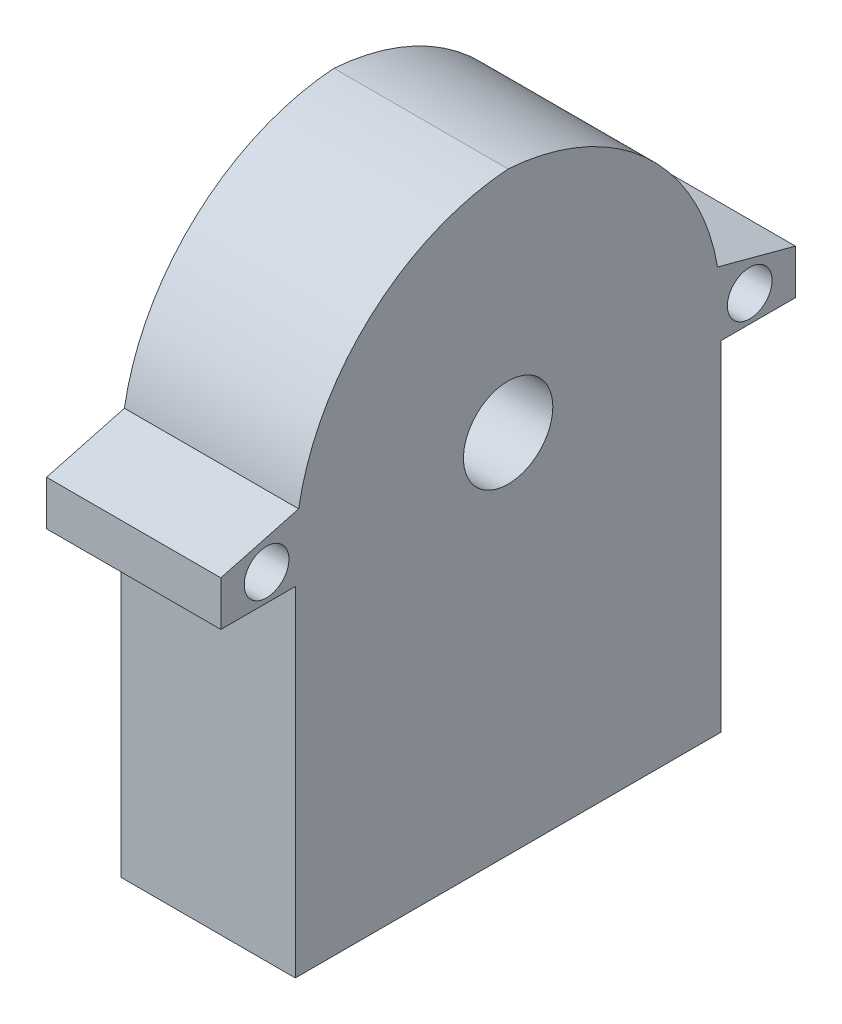
ISO-10303-21;
HEADER;
FILE_DESCRIPTION(('STEP AP214'),'2;1');
FILE_NAME('part.step','',(''),(''),'','','');
FILE_SCHEMA(('AUTOMOTIVE_DESIGN { 1 0 10303 214 1 1 1 1 }'));
ENDSEC;
DATA;
#1=APPLICATION_CONTEXT('core data for automotive mechanical design processes');
#2=APPLICATION_PROTOCOL_DEFINITION('international standard','automotive_design',2000,#1);
#3=PRODUCT_CONTEXT('',#1,'mechanical');
#4=PRODUCT('Part','Part','',(#3));
#5=PRODUCT_RELATED_PRODUCT_CATEGORY('part','',(#4));
#6=PRODUCT_DEFINITION_FORMATION('','',#4);
#7=PRODUCT_DEFINITION_CONTEXT('part definition',#1,'design');
#8=PRODUCT_DEFINITION('design','',#6,#7);
#9=PRODUCT_DEFINITION_SHAPE('','',#8);
#10=(LENGTH_UNIT() NAMED_UNIT(*) SI_UNIT(.MILLI.,.METRE.));
#11=(NAMED_UNIT(*) PLANE_ANGLE_UNIT() SI_UNIT($,.RADIAN.));
#12=(NAMED_UNIT(*) SI_UNIT($,.STERADIAN.) SOLID_ANGLE_UNIT());
#13=UNCERTAINTY_MEASURE_WITH_UNIT(LENGTH_MEASURE(1.E-05),#10,'distance_accuracy_value','');
#14=(GEOMETRIC_REPRESENTATION_CONTEXT(3) GLOBAL_UNCERTAINTY_ASSIGNED_CONTEXT((#13)) GLOBAL_UNIT_ASSIGNED_CONTEXT((#10,
#11,#12)) REPRESENTATION_CONTEXT('',''));
#15=CARTESIAN_POINT('',(0.,0.,0.));
#16=DIRECTION('',(0.,0.,1.));
#17=DIRECTION('',(1.,0.,0.));
#18=AXIS2_PLACEMENT_3D('',#15,#16,#17);
#19=CARTESIAN_POINT('',(11.7,20.896432160804,42.3673366834171));
#20=DIRECTION('',(0.,0.,-1.));
#21=DIRECTION('',(0.,1.,0.));
#22=AXIS2_PLACEMENT_3D('',#19,#20,#21);
#23=PLANE('',#22);
#24=DIRECTION('',(0.,-1.,0.));
#25=VECTOR('',#24,1.);
#26=CARTESIAN_POINT('',(11.7,20.896432160804,42.3673366834171));
#27=LINE('',#26,#25);
#28=CARTESIAN_POINT('',(11.7,3.72344059561265,42.3673366834171));
#29=VERTEX_POINT('',#28);
#30=CARTESIAN_POINT('',(11.7,-19.043567839196,42.3673366834171));
#31=VERTEX_POINT('',#30);
#32=EDGE_CURVE('E200',#29,#31,#27,.T.);
#33=ORIENTED_EDGE('',*,*,#32,.F.);
#34=DIRECTION('',(1.,0.,0.));
#35=VECTOR('',#34,1.);
#36=CARTESIAN_POINT('',(0.,3.72344059561265,42.3673366834171));
#37=LINE('',#36,#35);
#38=CARTESIAN_POINT('',(0.,3.72344059561265,42.3673366834171));
#39=VERTEX_POINT('',#38);
#40=EDGE_CURVE('E163',#39,#29,#37,.T.);
#41=ORIENTED_EDGE('',*,*,#40,.F.);
#42=DIRECTION('',(0.,-1.,0.));
#43=VECTOR('',#42,1.);
#44=CARTESIAN_POINT('',(0.,20.896432160804,42.3673366834171));
#45=LINE('',#44,#43);
#46=CARTESIAN_POINT('',(0.,-19.043567839196,42.3673366834171));
#47=VERTEX_POINT('',#46);
#48=EDGE_CURVE('E162',#39,#47,#45,.T.);
#49=ORIENTED_EDGE('',*,*,#48,.T.);
#50=DIRECTION('',(-1.,0.,0.));
#51=VECTOR('',#50,1.);
#52=CARTESIAN_POINT('',(11.7,-19.043567839196,42.3673366834171));
#53=LINE('',#52,#51);
#54=EDGE_CURVE('E148',#31,#47,#53,.T.);
#55=ORIENTED_EDGE('',*,*,#54,.F.);
#56=EDGE_LOOP('',(#33,#41,#49,#55));
#57=FACE_BOUND('',#56,.T.);
#58=ADVANCED_FACE('F39',(#57),#23,.F.);
#59=CARTESIAN_POINT('',(11.7,-19.043567839196,42.3673366834171));
#60=DIRECTION('',(0.,1.,0.));
#61=DIRECTION('',(0.,0.,1.));
#62=AXIS2_PLACEMENT_3D('',#59,#60,#61);
#63=PLANE('',#62);
#64=DIRECTION('',(0.,0.,-1.));
#65=VECTOR('',#64,1.);
#66=CARTESIAN_POINT('',(0.,-19.043567839196,42.3673366834171));
#67=LINE('',#66,#65);
#68=CARTESIAN_POINT('',(0.,-19.043567839196,13.7873366834171));
#69=VERTEX_POINT('',#68);
#70=EDGE_CURVE('E164',#47,#69,#67,.T.);
#71=ORIENTED_EDGE('',*,*,#70,.T.);
#72=DIRECTION('',(-1.,0.,0.));
#73=VECTOR('',#72,1.);
#74=CARTESIAN_POINT('',(11.7,-19.043567839196,13.7873366834171));
#75=LINE('',#74,#73);
#76=CARTESIAN_POINT('',(11.7,-19.043567839196,13.7873366834171));
#77=VERTEX_POINT('',#76);
#78=EDGE_CURVE('E152',#77,#69,#75,.T.);
#79=ORIENTED_EDGE('',*,*,#78,.F.);
#80=DIRECTION('',(0.,0.,-1.));
#81=VECTOR('',#80,1.);
#82=CARTESIAN_POINT('',(11.7,-19.043567839196,42.3673366834171));
#83=LINE('',#82,#81);
#84=EDGE_CURVE('E202',#31,#77,#83,.T.);
#85=ORIENTED_EDGE('',*,*,#84,.F.);
#86=ORIENTED_EDGE('',*,*,#54,.T.);
#87=EDGE_LOOP('',(#71,#79,#85,#86));
#88=FACE_BOUND('',#87,.T.);
#89=ADVANCED_FACE('F227',(#88),#63,.F.);
#90=CARTESIAN_POINT('',(11.7,-19.043567839196,13.7873366834171));
#91=DIRECTION('',(0.,0.,1.));
#92=DIRECTION('',(1.,0.,0.));
#93=AXIS2_PLACEMENT_3D('',#90,#91,#92);
#94=PLANE('',#93);
#95=DIRECTION('',(0.,1.,0.));
#96=VECTOR('',#95,1.);
#97=CARTESIAN_POINT('',(0.,-19.043567839196,13.7873366834171));
#98=LINE('',#97,#96);
#99=CARTESIAN_POINT('',(0.,3.72344059561265,13.7873366834171));
#100=VERTEX_POINT('',#99);
#101=EDGE_CURVE('E203',#69,#100,#98,.T.);
#102=ORIENTED_EDGE('',*,*,#101,.T.);
#103=DIRECTION('',(1.,0.,0.));
#104=VECTOR('',#103,1.);
#105=CARTESIAN_POINT('',(0.,3.72344059561265,13.7873366834171));
#106=LINE('',#105,#104);
#107=CARTESIAN_POINT('',(11.7,3.72344059561265,13.7873366834171));
#108=VERTEX_POINT('',#107);
#109=EDGE_CURVE('E176',#100,#108,#106,.T.);
#110=ORIENTED_EDGE('',*,*,#109,.T.);
#111=DIRECTION('',(0.,1.,0.));
#112=VECTOR('',#111,1.);
#113=CARTESIAN_POINT('',(11.7,-19.043567839196,13.7873366834171));
#114=LINE('',#113,#112);
#115=EDGE_CURVE('E205',#77,#108,#114,.T.);
#116=ORIENTED_EDGE('',*,*,#115,.F.);
#117=ORIENTED_EDGE('',*,*,#78,.T.);
#118=EDGE_LOOP('',(#102,#110,#116,#117));
#119=FACE_BOUND('',#118,.T.);
#120=ADVANCED_FACE('F215',(#119),#94,.F.);
#121=CARTESIAN_POINT('',(11.7,0.,0.));
#122=DIRECTION('',(1.,0.,0.));
#123=DIRECTION('',(0.,0.,-1.));
#124=AXIS2_PLACEMENT_3D('',#121,#122,#123);
#125=PLANE('',#124);
#126=CARTESIAN_POINT('',(11.7,5.52637682216266,28.0773366834171));
#127=DIRECTION('',(1.,0.,0.));
#128=DIRECTION('',(0.,0.,-1.));
#129=AXIS2_PLACEMENT_3D('',#126,#127,#128);
#130=CIRCLE('',#129,3.);
#131=CARTESIAN_POINT('',(11.7,5.52637682216266,25.0773366834171));
#132=VERTEX_POINT('',#131);
#133=EDGE_CURVE('E376',#132,#132,#130,.T.);
#134=ORIENTED_EDGE('',*,*,#133,.F.);
#135=EDGE_LOOP('',(#134));
#136=FACE_BOUND('',#135,.T.);
#137=CARTESIAN_POINT('',(11.7,5.52637682216266,44.2973366834171));
#138=DIRECTION('',(1.,0.,0.));
#139=DIRECTION('',(0.,0.,-1.));
#140=AXIS2_PLACEMENT_3D('',#137,#138,#139);
#141=CIRCLE('',#140,1.5);
#142=CARTESIAN_POINT('',(11.7,5.52637682216266,42.7973366834171));
#143=VERTEX_POINT('',#142);
#144=EDGE_CURVE('E383',#143,#143,#141,.T.);
#145=ORIENTED_EDGE('',*,*,#144,.F.);
#146=EDGE_LOOP('',(#145));
#147=FACE_BOUND('',#146,.T.);
#148=CARTESIAN_POINT('',(11.7,5.52637682216266,11.8573366834171));
#149=DIRECTION('',(1.,0.,0.));
#150=DIRECTION('',(0.,0.,-1.));
#151=AXIS2_PLACEMENT_3D('',#148,#149,#150);
#152=CIRCLE('',#151,1.5);
#153=CARTESIAN_POINT('',(11.7,5.52637682216266,10.3573366834171));
#154=VERTEX_POINT('',#153);
#155=EDGE_CURVE('E386',#154,#154,#152,.T.);
#156=ORIENTED_EDGE('',*,*,#155,.F.);
#157=EDGE_LOOP('',(#156));
#158=FACE_BOUND('',#157,.T.);
#159=DIRECTION('',(0.,0.,-1.));
#160=VECTOR('',#159,1.);
#161=CARTESIAN_POINT('',(11.7,3.72344059561265,47.3673366834171));
#162=LINE('',#161,#160);
#163=CARTESIAN_POINT('',(11.7,3.72344059561265,47.3673366834171));
#164=VERTEX_POINT('',#163);
#165=EDGE_CURVE('E143',#164,#29,#162,.T.);
#166=ORIENTED_EDGE('',*,*,#165,.T.);
#167=ORIENTED_EDGE('',*,*,#32,.T.);
#168=ORIENTED_EDGE('',*,*,#84,.T.);
#169=ORIENTED_EDGE('',*,*,#115,.T.);
#170=DIRECTION('',(0.,0.,-1.));
#171=VECTOR('',#170,1.);
#172=CARTESIAN_POINT('',(11.7,3.72344059561265,13.7873366834171));
#173=LINE('',#172,#171);
#174=CARTESIAN_POINT('',(11.7,3.72344059561265,8.78733668341708));
#175=VERTEX_POINT('',#174);
#176=EDGE_CURVE('E191',#108,#175,#173,.T.);
#177=ORIENTED_EDGE('',*,*,#176,.T.);
#178=DIRECTION('',(0.,1.,0.));
#179=VECTOR('',#178,1.);
#180=CARTESIAN_POINT('',(11.7,3.72344059561265,8.78733668341708));
#181=LINE('',#180,#179);
#182=CARTESIAN_POINT('',(11.7,6.72344059561265,8.78733668341708));
#183=VERTEX_POINT('',#182);
#184=EDGE_CURVE('E188',#175,#183,#181,.T.);
#185=ORIENTED_EDGE('',*,*,#184,.T.);
#186=DIRECTION('',(0.,0.258819045102518,0.965925826289069));
#187=VECTOR('',#186,1.);
#188=CARTESIAN_POINT('',(11.7,6.72344059561265,8.78733668341708));
#189=LINE('',#188,#187);
#190=CARTESIAN_POINT('',(11.7,8.12367862218153,14.0130961412621));
#191=VERTEX_POINT('',#190);
#192=EDGE_CURVE('E54',#183,#191,#189,.T.);
#193=ORIENTED_EDGE('',*,*,#192,.T.);
#194=CARTESIAN_POINT('',(11.7,5.49643216080401,29.1873366834171));
#195=DIRECTION('',(1.,0.,0.));
#196=DIRECTION('',(0.,0.,-1.));
#197=AXIS2_PLACEMENT_3D('',#194,#195,#196);
#198=CIRCLE('',#197,15.4);
#199=CARTESIAN_POINT('',(11.7,20.8563768221627,28.0773366834171));
#200=VERTEX_POINT('',#199);
#201=EDGE_CURVE('E11',#191,#200,#198,.T.);
#202=ORIENTED_EDGE('',*,*,#201,.T.);
#203=CARTESIAN_POINT('',(11.7,5.49643216080401,26.9673366834171));
#204=DIRECTION('',(1.,0.,0.));
#205=DIRECTION('',(0.,0.,-1.));
#206=AXIS2_PLACEMENT_3D('',#203,#204,#205);
#207=CIRCLE('',#206,15.4);
#208=CARTESIAN_POINT('',(11.7,8.12367862218152,42.141577225572));
#209=VERTEX_POINT('',#208);
#210=EDGE_CURVE('E48',#200,#209,#207,.T.);
#211=ORIENTED_EDGE('',*,*,#210,.T.);
#212=DIRECTION('',(0.,-0.258819045102519,0.965925826289069));
#213=VECTOR('',#212,1.);
#214=CARTESIAN_POINT('',(11.7,8.12367862218152,42.141577225572));
#215=LINE('',#214,#213);
#216=CARTESIAN_POINT('',(11.7,6.72344059561265,47.3673366834171));
#217=VERTEX_POINT('',#216);
#218=EDGE_CURVE('E127',#209,#217,#215,.T.);
#219=ORIENTED_EDGE('',*,*,#218,.T.);
#220=DIRECTION('',(0.,-1.,0.));
#221=VECTOR('',#220,1.);
#222=CARTESIAN_POINT('',(11.7,6.72344059561265,47.3673366834171));
#223=LINE('',#222,#221);
#224=EDGE_CURVE('E232',#217,#164,#223,.T.);
#225=ORIENTED_EDGE('',*,*,#224,.T.);
#226=EDGE_LOOP('',(#166,#167,#168,#169,#177,#185,#193,#202,#211,#219,#225));
#227=FACE_BOUND('',#226,.T.);
#228=ADVANCED_FACE('F157',(#136,#147,#158,#227),#125,.T.);
#229=CARTESIAN_POINT('',(0.,0.,0.));
#230=DIRECTION('',(1.,0.,0.));
#231=DIRECTION('',(0.,0.,-1.));
#232=AXIS2_PLACEMENT_3D('',#229,#230,#231);
#233=PLANE('',#232);
#234=CARTESIAN_POINT('',(0.,5.52637682216266,28.0773366834171));
#235=DIRECTION('',(1.,0.,0.));
#236=DIRECTION('',(0.,0.,-1.));
#237=AXIS2_PLACEMENT_3D('',#234,#235,#236);
#238=CIRCLE('',#237,3.);
#239=CARTESIAN_POINT('',(0.,5.52637682216266,25.0773366834171));
#240=VERTEX_POINT('',#239);
#241=EDGE_CURVE('E373',#240,#240,#238,.T.);
#242=ORIENTED_EDGE('',*,*,#241,.T.);
#243=EDGE_LOOP('',(#242));
#244=FACE_BOUND('',#243,.T.);
#245=CARTESIAN_POINT('',(0.,5.52637682216266,44.2973366834171));
#246=DIRECTION('',(1.,0.,0.));
#247=DIRECTION('',(0.,0.,-1.));
#248=AXIS2_PLACEMENT_3D('',#245,#246,#247);
#249=CIRCLE('',#248,1.5);
#250=CARTESIAN_POINT('',(0.,5.52637682216266,42.7973366834171));
#251=VERTEX_POINT('',#250);
#252=EDGE_CURVE('E186',#251,#251,#249,.T.);
#253=ORIENTED_EDGE('',*,*,#252,.T.);
#254=EDGE_LOOP('',(#253));
#255=FACE_BOUND('',#254,.T.);
#256=CARTESIAN_POINT('',(0.,5.52637682216266,11.8573366834171));
#257=DIRECTION('',(1.,0.,0.));
#258=DIRECTION('',(0.,0.,-1.));
#259=AXIS2_PLACEMENT_3D('',#256,#257,#258);
#260=CIRCLE('',#259,1.5);
#261=CARTESIAN_POINT('',(0.,5.52637682216266,10.3573366834171));
#262=VERTEX_POINT('',#261);
#263=EDGE_CURVE('E378',#262,#262,#260,.T.);
#264=ORIENTED_EDGE('',*,*,#263,.T.);
#265=EDGE_LOOP('',(#264));
#266=FACE_BOUND('',#265,.T.);
#267=ORIENTED_EDGE('',*,*,#48,.F.);
#268=DIRECTION('',(0.,0.,-1.));
#269=VECTOR('',#268,1.);
#270=CARTESIAN_POINT('',(0.,3.72344059561265,47.3673366834171));
#271=LINE('',#270,#269);
#272=CARTESIAN_POINT('',(0.,3.72344059561265,47.3673366834171));
#273=VERTEX_POINT('',#272);
#274=EDGE_CURVE('E131',#273,#39,#271,.T.);
#275=ORIENTED_EDGE('',*,*,#274,.F.);
#276=DIRECTION('',(0.,-1.,0.));
#277=VECTOR('',#276,1.);
#278=CARTESIAN_POINT('',(0.,6.72344059561265,47.3673366834171));
#279=LINE('',#278,#277);
#280=CARTESIAN_POINT('',(0.,6.72344059561265,47.3673366834171));
#281=VERTEX_POINT('',#280);
#282=EDGE_CURVE('E142',#281,#273,#279,.T.);
#283=ORIENTED_EDGE('',*,*,#282,.F.);
#284=DIRECTION('',(0.,-0.258819045102519,0.965925826289069));
#285=VECTOR('',#284,1.);
#286=CARTESIAN_POINT('',(0.,8.12367862218152,42.141577225572));
#287=LINE('',#286,#285);
#288=CARTESIAN_POINT('',(0.,8.12367862218152,42.141577225572));
#289=VERTEX_POINT('',#288);
#290=EDGE_CURVE('E125',#289,#281,#287,.T.);
#291=ORIENTED_EDGE('',*,*,#290,.F.);
#292=CARTESIAN_POINT('',(0.,5.49643216080401,26.9673366834171));
#293=DIRECTION('',(1.,0.,0.));
#294=DIRECTION('',(0.,0.,-1.));
#295=AXIS2_PLACEMENT_3D('',#292,#293,#294);
#296=CIRCLE('',#295,15.4);
#297=CARTESIAN_POINT('',(0.,20.8563768221627,28.0773366834171));
#298=VERTEX_POINT('',#297);
#299=EDGE_CURVE('E138',#289,#298,#296,.F.);
#300=ORIENTED_EDGE('',*,*,#299,.T.);
#301=CARTESIAN_POINT('',(0.,5.49643216080401,29.1873366834171));
#302=DIRECTION('',(1.,0.,0.));
#303=DIRECTION('',(0.,0.,-1.));
#304=AXIS2_PLACEMENT_3D('',#301,#302,#303);
#305=CIRCLE('',#304,15.4);
#306=CARTESIAN_POINT('',(0.,8.12367862218151,14.0130961412621));
#307=VERTEX_POINT('',#306);
#308=EDGE_CURVE('E147',#298,#307,#305,.F.);
#309=ORIENTED_EDGE('',*,*,#308,.T.);
#310=DIRECTION('',(0.,0.258819045102518,0.965925826289069));
#311=VECTOR('',#310,1.);
#312=CARTESIAN_POINT('',(0.,6.72344059561265,8.78733668341708));
#313=LINE('',#312,#311);
#314=CARTESIAN_POINT('',(0.,6.72344059561265,8.78733668341708));
#315=VERTEX_POINT('',#314);
#316=EDGE_CURVE('E179',#315,#307,#313,.T.);
#317=ORIENTED_EDGE('',*,*,#316,.F.);
#318=DIRECTION('',(0.,1.,0.));
#319=VECTOR('',#318,1.);
#320=CARTESIAN_POINT('',(0.,3.72344059561265,8.78733668341708));
#321=LINE('',#320,#319);
#322=CARTESIAN_POINT('',(0.,3.72344059561265,8.78733668341708));
#323=VERTEX_POINT('',#322);
#324=EDGE_CURVE('E195',#323,#315,#321,.T.);
#325=ORIENTED_EDGE('',*,*,#324,.F.);
#326=DIRECTION('',(0.,0.,-1.));
#327=VECTOR('',#326,1.);
#328=CARTESIAN_POINT('',(0.,3.72344059561265,13.7873366834171));
#329=LINE('',#328,#327);
#330=EDGE_CURVE('E189',#100,#323,#329,.T.);
#331=ORIENTED_EDGE('',*,*,#330,.F.);
#332=ORIENTED_EDGE('',*,*,#101,.F.);
#333=ORIENTED_EDGE('',*,*,#70,.F.);
#334=EDGE_LOOP('',(#267,#275,#283,#291,#300,#309,#317,#325,#331,#332,#333));
#335=FACE_BOUND('',#334,.T.);
#336=ADVANCED_FACE('F136',(#244,#255,#266,#335),#233,.F.);
#337=CARTESIAN_POINT('',(11.7,5.49643216080401,26.9673366834171));
#338=DIRECTION('',(-1.,0.,0.));
#339=DIRECTION('',(0.,0.,1.));
#340=AXIS2_PLACEMENT_3D('',#337,#338,#339);
#341=CYLINDRICAL_SURFACE('',#340,15.4);
#342=DIRECTION('',(1.,0.,0.));
#343=VECTOR('',#342,1.);
#344=CARTESIAN_POINT('',(0.,8.12367862218152,42.141577225572));
#345=LINE('',#344,#343);
#346=EDGE_CURVE('E122',#289,#209,#345,.T.);
#347=ORIENTED_EDGE('',*,*,#346,.T.);
#348=ORIENTED_EDGE('',*,*,#210,.F.);
#349=DIRECTION('',(-1.,0.,0.));
#350=VECTOR('',#349,1.);
#351=CARTESIAN_POINT('',(5.85,20.8563768221627,28.0773366834171));
#352=LINE('',#351,#350);
#353=EDGE_CURVE('E43',#298,#200,#352,.F.);
#354=ORIENTED_EDGE('',*,*,#353,.F.);
#355=ORIENTED_EDGE('',*,*,#299,.F.);
#356=EDGE_LOOP('',(#347,#348,#354,#355));
#357=FACE_BOUND('',#356,.T.);
#358=ADVANCED_FACE('F41',(#357),#341,.T.);
#359=CARTESIAN_POINT('',(11.7,5.49643216080401,29.1873366834171));
#360=DIRECTION('',(-1.,0.,0.));
#361=DIRECTION('',(0.,0.,1.));
#362=AXIS2_PLACEMENT_3D('',#359,#360,#361);
#363=CYLINDRICAL_SURFACE('',#362,15.4);
#364=DIRECTION('',(1.,0.,0.));
#365=VECTOR('',#364,1.);
#366=CARTESIAN_POINT('',(0.,8.12367862218151,14.0130961412621));
#367=LINE('',#366,#365);
#368=EDGE_CURVE('E184',#307,#191,#367,.T.);
#369=ORIENTED_EDGE('',*,*,#368,.F.);
#370=ORIENTED_EDGE('',*,*,#308,.F.);
#371=ORIENTED_EDGE('',*,*,#353,.T.);
#372=ORIENTED_EDGE('',*,*,#201,.F.);
#373=EDGE_LOOP('',(#369,#370,#371,#372));
#374=FACE_BOUND('',#373,.T.);
#375=ADVANCED_FACE('F161',(#374),#363,.T.);
#376=CARTESIAN_POINT('',(0.,6.72344059561265,8.78733668341708));
#377=DIRECTION('',(0.,0.965925826289069,-0.258819045102518));
#378=DIRECTION('',(0.,0.258819045102518,0.965925826289069));
#379=AXIS2_PLACEMENT_3D('',#376,#377,#378);
#380=PLANE('',#379);
#381=ORIENTED_EDGE('',*,*,#192,.F.);
#382=DIRECTION('',(1.,0.,0.));
#383=VECTOR('',#382,1.);
#384=CARTESIAN_POINT('',(0.,6.72344059561265,8.78733668341708));
#385=LINE('',#384,#383);
#386=EDGE_CURVE('E182',#315,#183,#385,.T.);
#387=ORIENTED_EDGE('',*,*,#386,.F.);
#388=ORIENTED_EDGE('',*,*,#316,.T.);
#389=ORIENTED_EDGE('',*,*,#368,.T.);
#390=EDGE_LOOP('',(#381,#387,#388,#389));
#391=FACE_BOUND('',#390,.T.);
#392=ADVANCED_FACE('F255',(#391),#380,.T.);
#393=CARTESIAN_POINT('',(0.,3.72344059561265,8.78733668341708));
#394=DIRECTION('',(0.,0.,-1.));
#395=DIRECTION('',(-1.,0.,0.));
#396=AXIS2_PLACEMENT_3D('',#393,#394,#395);
#397=PLANE('',#396);
#398=ORIENTED_EDGE('',*,*,#184,.F.);
#399=DIRECTION('',(1.,0.,0.));
#400=VECTOR('',#399,1.);
#401=CARTESIAN_POINT('',(0.,3.72344059561265,8.78733668341708));
#402=LINE('',#401,#400);
#403=EDGE_CURVE('E180',#323,#175,#402,.T.);
#404=ORIENTED_EDGE('',*,*,#403,.F.);
#405=ORIENTED_EDGE('',*,*,#324,.T.);
#406=ORIENTED_EDGE('',*,*,#386,.T.);
#407=EDGE_LOOP('',(#398,#404,#405,#406));
#408=FACE_BOUND('',#407,.T.);
#409=ADVANCED_FACE('F260',(#408),#397,.T.);
#410=CARTESIAN_POINT('',(0.,3.72344059561265,13.7873366834171));
#411=DIRECTION('',(0.,-1.,0.));
#412=DIRECTION('',(0.,0.,-1.));
#413=AXIS2_PLACEMENT_3D('',#410,#411,#412);
#414=PLANE('',#413);
#415=ORIENTED_EDGE('',*,*,#176,.F.);
#416=ORIENTED_EDGE('',*,*,#109,.F.);
#417=ORIENTED_EDGE('',*,*,#330,.T.);
#418=ORIENTED_EDGE('',*,*,#403,.T.);
#419=EDGE_LOOP('',(#415,#416,#417,#418));
#420=FACE_BOUND('',#419,.T.);
#421=ADVANCED_FACE('F223',(#420),#414,.T.);
#422=CARTESIAN_POINT('',(0.,3.72344059561265,47.3673366834171));
#423=DIRECTION('',(0.,-1.,0.));
#424=DIRECTION('',(0.,0.,-1.));
#425=AXIS2_PLACEMENT_3D('',#422,#423,#424);
#426=PLANE('',#425);
#427=ORIENTED_EDGE('',*,*,#165,.F.);
#428=DIRECTION('',(1.,0.,0.));
#429=VECTOR('',#428,1.);
#430=CARTESIAN_POINT('',(0.,3.72344059561265,47.3673366834171));
#431=LINE('',#430,#429);
#432=EDGE_CURVE('E166',#273,#164,#431,.T.);
#433=ORIENTED_EDGE('',*,*,#432,.F.);
#434=ORIENTED_EDGE('',*,*,#274,.T.);
#435=ORIENTED_EDGE('',*,*,#40,.T.);
#436=EDGE_LOOP('',(#427,#433,#434,#435));
#437=FACE_BOUND('',#436,.T.);
#438=ADVANCED_FACE('F234',(#437),#426,.T.);
#439=CARTESIAN_POINT('',(0.,6.72344059561265,47.3673366834171));
#440=DIRECTION('',(0.,0.,1.));
#441=DIRECTION('',(1.,0.,0.));
#442=AXIS2_PLACEMENT_3D('',#439,#440,#441);
#443=PLANE('',#442);
#444=ORIENTED_EDGE('',*,*,#224,.F.);
#445=DIRECTION('',(1.,0.,0.));
#446=VECTOR('',#445,1.);
#447=CARTESIAN_POINT('',(0.,6.72344059561265,47.3673366834171));
#448=LINE('',#447,#446);
#449=EDGE_CURVE('E130',#281,#217,#448,.T.);
#450=ORIENTED_EDGE('',*,*,#449,.F.);
#451=ORIENTED_EDGE('',*,*,#282,.T.);
#452=ORIENTED_EDGE('',*,*,#432,.T.);
#453=EDGE_LOOP('',(#444,#450,#451,#452));
#454=FACE_BOUND('',#453,.T.);
#455=ADVANCED_FACE('F236',(#454),#443,.T.);
#456=CARTESIAN_POINT('',(0.,8.12367862218152,42.141577225572));
#457=DIRECTION('',(0.,0.965925826289069,0.258819045102519));
#458=DIRECTION('',(0.,-0.258819045102519,0.965925826289069));
#459=AXIS2_PLACEMENT_3D('',#456,#457,#458);
#460=PLANE('',#459);
#461=ORIENTED_EDGE('',*,*,#218,.F.);
#462=ORIENTED_EDGE('',*,*,#346,.F.);
#463=ORIENTED_EDGE('',*,*,#290,.T.);
#464=ORIENTED_EDGE('',*,*,#449,.T.);
#465=EDGE_LOOP('',(#461,#462,#463,#464));
#466=FACE_BOUND('',#465,.T.);
#467=ADVANCED_FACE('F124',(#466),#460,.T.);
#468=CARTESIAN_POINT('',(0.,5.52637682216266,11.8573366834171));
#469=DIRECTION('',(1.,0.,0.));
#470=DIRECTION('',(0.,0.,-1.));
#471=AXIS2_PLACEMENT_3D('',#468,#469,#470);
#472=CYLINDRICAL_SURFACE('',#471,1.5);
#473=ORIENTED_EDGE('',*,*,#263,.F.);
#474=EDGE_LOOP('',(#473));
#475=FACE_BOUND('',#474,.T.);
#476=ORIENTED_EDGE('',*,*,#155,.T.);
#477=EDGE_LOOP('',(#476));
#478=FACE_BOUND('',#477,.T.);
#479=ADVANCED_FACE('F243',(#475,#478),#472,.F.);
#480=CARTESIAN_POINT('',(0.,5.52637682216266,44.2973366834171));
#481=DIRECTION('',(1.,0.,0.));
#482=DIRECTION('',(0.,0.,-1.));
#483=AXIS2_PLACEMENT_3D('',#480,#481,#482);
#484=CYLINDRICAL_SURFACE('',#483,1.5);
#485=ORIENTED_EDGE('',*,*,#252,.F.);
#486=EDGE_LOOP('',(#485));
#487=FACE_BOUND('',#486,.T.);
#488=ORIENTED_EDGE('',*,*,#144,.T.);
#489=EDGE_LOOP('',(#488));
#490=FACE_BOUND('',#489,.T.);
#491=ADVANCED_FACE('F350',(#487,#490),#484,.F.);
#492=CARTESIAN_POINT('',(0.,5.52637682216266,28.0773366834171));
#493=DIRECTION('',(1.,0.,0.));
#494=DIRECTION('',(0.,0.,-1.));
#495=AXIS2_PLACEMENT_3D('',#492,#493,#494);
#496=CYLINDRICAL_SURFACE('',#495,3.);
#497=ORIENTED_EDGE('',*,*,#241,.F.);
#498=EDGE_LOOP('',(#497));
#499=FACE_BOUND('',#498,.T.);
#500=ORIENTED_EDGE('',*,*,#133,.T.);
#501=EDGE_LOOP('',(#500));
#502=FACE_BOUND('',#501,.T.);
#503=ADVANCED_FACE('F359',(#499,#502),#496,.F.);
#504=CLOSED_SHELL('',(#58,#89,#120,#228,#336,#358,#375,#392,#409,#421,#438,#455,#467,#479,#491,#503));
#505=MANIFOLD_SOLID_BREP('B2',#504);
#506=ADVANCED_BREP_SHAPE_REPRESENTATION('',(#18,#505),#14);
#507=SHAPE_DEFINITION_REPRESENTATION(#9,#506);
ENDSEC;
END-ISO-10303-21;
